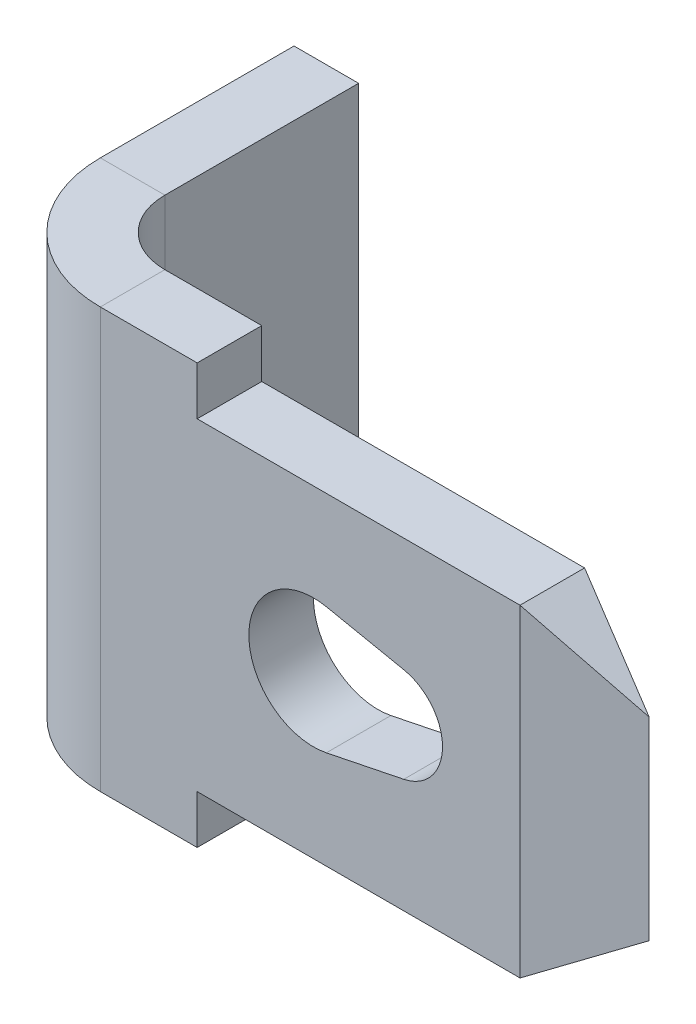
ISO-10303-21;
HEADER;
FILE_DESCRIPTION(('STEP AP214'),'2;1');
FILE_NAME('part.step','',(''),(''),'','','');
FILE_SCHEMA(('AUTOMOTIVE_DESIGN { 1 0 10303 214 1 1 1 1 }'));
ENDSEC;
DATA;
#1=APPLICATION_CONTEXT('core data for automotive mechanical design processes');
#2=APPLICATION_PROTOCOL_DEFINITION('international standard','automotive_design',2000,#1);
#3=PRODUCT_CONTEXT('',#1,'mechanical');
#4=PRODUCT('Part','Part','',(#3));
#5=PRODUCT_RELATED_PRODUCT_CATEGORY('part','',(#4));
#6=PRODUCT_DEFINITION_FORMATION('','',#4);
#7=PRODUCT_DEFINITION_CONTEXT('part definition',#1,'design');
#8=PRODUCT_DEFINITION('design','',#6,#7);
#9=PRODUCT_DEFINITION_SHAPE('','',#8);
#10=(LENGTH_UNIT() NAMED_UNIT(*) SI_UNIT(.MILLI.,.METRE.));
#11=(NAMED_UNIT(*) PLANE_ANGLE_UNIT() SI_UNIT($,.RADIAN.));
#12=(NAMED_UNIT(*) SI_UNIT($,.STERADIAN.) SOLID_ANGLE_UNIT());
#13=UNCERTAINTY_MEASURE_WITH_UNIT(LENGTH_MEASURE(1.E-05),#10,'distance_accuracy_value','');
#14=(GEOMETRIC_REPRESENTATION_CONTEXT(3) GLOBAL_UNCERTAINTY_ASSIGNED_CONTEXT((#13)) GLOBAL_UNIT_ASSIGNED_CONTEXT((#10,
#11,#12)) REPRESENTATION_CONTEXT('',''));
#15=CARTESIAN_POINT('',(0.,0.,0.));
#16=DIRECTION('',(0.,0.,1.));
#17=DIRECTION('',(1.,0.,0.));
#18=AXIS2_PLACEMENT_3D('',#15,#16,#17);
#19=CARTESIAN_POINT('',(7.55,0.,0.));
#20=DIRECTION('',(0.,0.,-1.));
#21=DIRECTION('',(-1.,0.,0.));
#22=AXIS2_PLACEMENT_3D('',#19,#20,#21);
#23=CYLINDRICAL_SURFACE('',#22,0.75);
#24=DIRECTION('',(0.,0.,-1.));
#25=VECTOR('',#24,1.);
#26=CARTESIAN_POINT('',(7.7,-0.734846922834954,0.));
#27=LINE('',#26,#25);
#28=CARTESIAN_POINT('',(7.7,-0.734846922834953,1.));
#29=VERTEX_POINT('',#28);
#30=CARTESIAN_POINT('',(7.7,-0.734846922834954,0.));
#31=VERTEX_POINT('',#30);
#32=EDGE_CURVE('E12',#29,#31,#27,.T.);
#33=ORIENTED_EDGE('',*,*,#32,.F.);
#34=CARTESIAN_POINT('',(7.55,0.,0.999999999999999));
#35=DIRECTION('',(0.,0.,-1.));
#36=DIRECTION('',(-1.,0.,0.));
#37=AXIS2_PLACEMENT_3D('',#34,#35,#36);
#38=CIRCLE('',#37,0.75);
#39=CARTESIAN_POINT('',(7.7,0.734846922834953,1.));
#40=VERTEX_POINT('',#39);
#41=EDGE_CURVE('E141',#29,#40,#38,.F.);
#42=ORIENTED_EDGE('',*,*,#41,.T.);
#43=DIRECTION('',(0.,0.,-1.));
#44=VECTOR('',#43,1.);
#45=CARTESIAN_POINT('',(7.7,0.734846922834953,0.));
#46=LINE('',#45,#44);
#47=CARTESIAN_POINT('',(7.7,0.734846922834953,0.));
#48=VERTEX_POINT('',#47);
#49=EDGE_CURVE('E62',#40,#48,#46,.T.);
#50=ORIENTED_EDGE('',*,*,#49,.T.);
#51=CARTESIAN_POINT('',(7.55,0.,0.));
#52=DIRECTION('',(0.,0.,-1.));
#53=DIRECTION('',(-1.,0.,0.));
#54=AXIS2_PLACEMENT_3D('',#51,#52,#53);
#55=CIRCLE('',#54,0.75);
#56=EDGE_CURVE('E196',#31,#48,#55,.F.);
#57=ORIENTED_EDGE('',*,*,#56,.F.);
#58=EDGE_LOOP('',(#33,#42,#50,#57));
#59=FACE_BOUND('',#58,.T.);
#60=ADVANCED_FACE('F52',(#59),#23,.F.);
#61=CARTESIAN_POINT('',(6.5,0.979795897113271,0.));
#62=DIRECTION('',(-0.2,-0.979795897113271,0.));
#63=DIRECTION('',(-0.979795897113271,0.2,0.));
#64=AXIS2_PLACEMENT_3D('',#61,#62,#63);
#65=PLANE('',#64);
#66=ORIENTED_EDGE('',*,*,#49,.F.);
#67=DIRECTION('',(-0.979795897113271,0.2,0.));
#68=VECTOR('',#67,1.);
#69=CARTESIAN_POINT('',(6.5,0.979795897113271,0.999999999999999));
#70=LINE('',#69,#68);
#71=CARTESIAN_POINT('',(6.5,0.97979589711327,1.));
#72=VERTEX_POINT('',#71);
#73=EDGE_CURVE('E154',#40,#72,#70,.T.);
#74=ORIENTED_EDGE('',*,*,#73,.T.);
#75=DIRECTION('',(0.,0.,-1.));
#76=VECTOR('',#75,1.);
#77=CARTESIAN_POINT('',(6.5,0.979795897113271,0.));
#78=LINE('',#77,#76);
#79=CARTESIAN_POINT('',(6.5,0.979795897113271,0.));
#80=VERTEX_POINT('',#79);
#81=EDGE_CURVE('E133',#72,#80,#78,.T.);
#82=ORIENTED_EDGE('',*,*,#81,.T.);
#83=DIRECTION('',(-0.979795897113271,0.2,0.));
#84=VECTOR('',#83,1.);
#85=CARTESIAN_POINT('',(6.5,0.979795897113271,0.));
#86=LINE('',#85,#84);
#87=EDGE_CURVE('E204',#48,#80,#86,.T.);
#88=ORIENTED_EDGE('',*,*,#87,.F.);
#89=EDGE_LOOP('',(#66,#74,#82,#88));
#90=FACE_BOUND('',#89,.T.);
#91=ADVANCED_FACE('F206',(#90),#65,.T.);
#92=CARTESIAN_POINT('',(6.3,0.,0.));
#93=DIRECTION('',(0.,0.,-1.));
#94=DIRECTION('',(-1.,0.,0.));
#95=AXIS2_PLACEMENT_3D('',#92,#93,#94);
#96=CYLINDRICAL_SURFACE('',#95,1.);
#97=ORIENTED_EDGE('',*,*,#81,.F.);
#98=CARTESIAN_POINT('',(6.3,0.,0.999999999999999));
#99=DIRECTION('',(0.,0.,-1.));
#100=DIRECTION('',(-1.,0.,0.));
#101=AXIS2_PLACEMENT_3D('',#98,#99,#100);
#102=CIRCLE('',#101,1.);
#103=CARTESIAN_POINT('',(6.5,-0.979795897113271,1.));
#104=VERTEX_POINT('',#103);
#105=EDGE_CURVE('E139',#72,#104,#102,.F.);
#106=ORIENTED_EDGE('',*,*,#105,.T.);
#107=DIRECTION('',(0.,0.,-1.));
#108=VECTOR('',#107,1.);
#109=CARTESIAN_POINT('',(6.5,-0.979795897113272,0.));
#110=LINE('',#109,#108);
#111=CARTESIAN_POINT('',(6.5,-0.979795897113272,0.));
#112=VERTEX_POINT('',#111);
#113=EDGE_CURVE('E56',#104,#112,#110,.T.);
#114=ORIENTED_EDGE('',*,*,#113,.T.);
#115=CARTESIAN_POINT('',(6.3,0.,0.));
#116=DIRECTION('',(0.,0.,-1.));
#117=DIRECTION('',(-1.,0.,0.));
#118=AXIS2_PLACEMENT_3D('',#115,#116,#117);
#119=CIRCLE('',#118,1.);
#120=EDGE_CURVE('E304',#80,#112,#119,.F.);
#121=ORIENTED_EDGE('',*,*,#120,.F.);
#122=EDGE_LOOP('',(#97,#106,#114,#121));
#123=FACE_BOUND('',#122,.T.);
#124=ADVANCED_FACE('F143',(#123),#96,.F.);
#125=CARTESIAN_POINT('',(2.,-3.25,-4.));
#126=DIRECTION('',(0.,-1.,0.));
#127=DIRECTION('',(0.,0.,1.));
#128=AXIS2_PLACEMENT_3D('',#125,#126,#127);
#129=PLANE('',#128);
#130=DIRECTION('',(1.,0.,0.));
#131=VECTOR('',#130,1.);
#132=CARTESIAN_POINT('',(2.,-3.25,-1.));
#133=LINE('',#132,#131);
#134=CARTESIAN_POINT('',(0.999999999999999,-3.25,-1.));
#135=VERTEX_POINT('',#134);
#136=CARTESIAN_POINT('',(2.,-3.25,-1.));
#137=VERTEX_POINT('',#136);
#138=EDGE_CURVE('E134',#135,#137,#133,.T.);
#139=ORIENTED_EDGE('',*,*,#138,.F.);
#140=DIRECTION('',(0.,0.,1.));
#141=VECTOR('',#140,1.);
#142=CARTESIAN_POINT('',(0.999999999999999,-3.25,-4.));
#143=LINE('',#142,#141);
#144=CARTESIAN_POINT('',(0.999999999999999,-3.25,-4.));
#145=VERTEX_POINT('',#144);
#146=EDGE_CURVE('E245',#145,#135,#143,.T.);
#147=ORIENTED_EDGE('',*,*,#146,.F.);
#148=DIRECTION('',(1.,0.,0.));
#149=VECTOR('',#148,1.);
#150=CARTESIAN_POINT('',(2.,-3.25,-4.));
#151=LINE('',#150,#149);
#152=CARTESIAN_POINT('',(2.,-3.25,-4.));
#153=VERTEX_POINT('',#152);
#154=EDGE_CURVE('E184',#145,#153,#151,.T.);
#155=ORIENTED_EDGE('',*,*,#154,.T.);
#156=DIRECTION('',(0.,0.,1.));
#157=VECTOR('',#156,1.);
#158=CARTESIAN_POINT('',(2.,-3.25,-4.));
#159=LINE('',#158,#157);
#160=EDGE_CURVE('E222',#153,#137,#159,.T.);
#161=ORIENTED_EDGE('',*,*,#160,.T.);
#162=EDGE_LOOP('',(#139,#147,#155,#161));
#163=FACE_BOUND('',#162,.T.);
#164=ADVANCED_FACE('F326',(#163),#129,.T.);
#165=CARTESIAN_POINT('',(2.,-3.25,-4.));
#166=DIRECTION('',(0.,0.,-1.));
#167=DIRECTION('',(0.,-1.,0.));
#168=AXIS2_PLACEMENT_3D('',#165,#166,#167);
#169=PLANE('',#168);
#170=ORIENTED_EDGE('',*,*,#154,.F.);
#171=DIRECTION('',(0.,1.,0.));
#172=VECTOR('',#171,1.);
#173=CARTESIAN_POINT('',(0.999999999999999,-3.25,-4.));
#174=LINE('',#173,#172);
#175=CARTESIAN_POINT('',(0.999999999999999,3.25,-4.));
#176=VERTEX_POINT('',#175);
#177=EDGE_CURVE('E248',#176,#145,#174,.F.);
#178=ORIENTED_EDGE('',*,*,#177,.F.);
#179=DIRECTION('',(1.,0.,0.));
#180=VECTOR('',#179,1.);
#181=CARTESIAN_POINT('',(2.,3.25,-4.));
#182=LINE('',#181,#180);
#183=CARTESIAN_POINT('',(2.,3.25,-4.));
#184=VERTEX_POINT('',#183);
#185=EDGE_CURVE('E181',#176,#184,#182,.T.);
#186=ORIENTED_EDGE('',*,*,#185,.T.);
#187=DIRECTION('',(0.,-1.,0.));
#188=VECTOR('',#187,1.);
#189=CARTESIAN_POINT('',(2.,-3.25,-4.));
#190=LINE('',#189,#188);
#191=EDGE_CURVE('E281',#184,#153,#190,.T.);
#192=ORIENTED_EDGE('',*,*,#191,.T.);
#193=EDGE_LOOP('',(#170,#178,#186,#192));
#194=FACE_BOUND('',#193,.T.);
#195=ADVANCED_FACE('F329',(#194),#169,.T.);
#196=CARTESIAN_POINT('',(2.,3.25,-4.));
#197=DIRECTION('',(0.,-1.,0.));
#198=DIRECTION('',(0.,0.,1.));
#199=AXIS2_PLACEMENT_3D('',#196,#197,#198);
#200=PLANE('',#199);
#201=ORIENTED_EDGE('',*,*,#185,.F.);
#202=DIRECTION('',(0.,0.,1.));
#203=VECTOR('',#202,1.);
#204=CARTESIAN_POINT('',(0.999999999999999,3.25,-4.));
#205=LINE('',#204,#203);
#206=CARTESIAN_POINT('',(0.999999999999999,3.25,-1.));
#207=VERTEX_POINT('',#206);
#208=EDGE_CURVE('E241',#176,#207,#205,.T.);
#209=ORIENTED_EDGE('',*,*,#208,.T.);
#210=DIRECTION('',(1.,0.,0.));
#211=VECTOR('',#210,1.);
#212=CARTESIAN_POINT('',(2.,3.25,-1.));
#213=LINE('',#212,#211);
#214=CARTESIAN_POINT('',(2.,3.25,-1.));
#215=VERTEX_POINT('',#214);
#216=EDGE_CURVE('E178',#207,#215,#213,.T.);
#217=ORIENTED_EDGE('',*,*,#216,.T.);
#218=DIRECTION('',(0.,0.,1.));
#219=VECTOR('',#218,1.);
#220=CARTESIAN_POINT('',(2.,3.25,-4.));
#221=LINE('',#220,#219);
#222=EDGE_CURVE('E284',#184,#215,#221,.T.);
#223=ORIENTED_EDGE('',*,*,#222,.F.);
#224=EDGE_LOOP('',(#201,#209,#217,#223));
#225=FACE_BOUND('',#224,.T.);
#226=ADVANCED_FACE('F312',(#225),#200,.F.);
#227=CARTESIAN_POINT('',(3.,3.25,-1.));
#228=DIRECTION('',(0.,-1.,0.));
#229=DIRECTION('',(0.,0.,-1.));
#230=AXIS2_PLACEMENT_3D('',#227,#228,#229);
#231=PLANE('',#230);
#232=ORIENTED_EDGE('',*,*,#216,.F.);
#233=CARTESIAN_POINT('',(3.,3.25,-1.));
#234=DIRECTION('',(0.,-1.,0.));
#235=DIRECTION('',(0.,0.,-1.));
#236=AXIS2_PLACEMENT_3D('',#233,#234,#235);
#237=CIRCLE('',#236,2.);
#238=CARTESIAN_POINT('',(3.,3.25,1.));
#239=VERTEX_POINT('',#238);
#240=EDGE_CURVE('E242',#207,#239,#237,.F.);
#241=ORIENTED_EDGE('',*,*,#240,.T.);
#242=DIRECTION('',(0.,0.,-1.));
#243=VECTOR('',#242,1.);
#244=CARTESIAN_POINT('',(3.,3.25,0.));
#245=LINE('',#244,#243);
#246=CARTESIAN_POINT('',(3.,3.25,0.));
#247=VERTEX_POINT('',#246);
#248=EDGE_CURVE('E176',#239,#247,#245,.T.);
#249=ORIENTED_EDGE('',*,*,#248,.T.);
#250=CARTESIAN_POINT('',(3.,3.25,-1.));
#251=DIRECTION('',(0.,1.,0.));
#252=DIRECTION('',(0.,0.,1.));
#253=AXIS2_PLACEMENT_3D('',#250,#251,#252);
#254=CIRCLE('',#253,1.);
#255=EDGE_CURVE('E218',#215,#247,#254,.T.);
#256=ORIENTED_EDGE('',*,*,#255,.F.);
#257=EDGE_LOOP('',(#232,#241,#249,#256));
#258=FACE_BOUND('',#257,.T.);
#259=ADVANCED_FACE('F321',(#258),#231,.F.);
#260=CARTESIAN_POINT('',(0.,3.25,0.));
#261=DIRECTION('',(0.,-1.,0.));
#262=DIRECTION('',(-1.,0.,0.));
#263=AXIS2_PLACEMENT_3D('',#260,#261,#262);
#264=PLANE('',#263);
#265=ORIENTED_EDGE('',*,*,#248,.F.);
#266=DIRECTION('',(-1.,0.,0.));
#267=VECTOR('',#266,1.);
#268=CARTESIAN_POINT('',(0.,3.25,1.));
#269=LINE('',#268,#267);
#270=CARTESIAN_POINT('',(4.5,3.25,1.));
#271=VERTEX_POINT('',#270);
#272=EDGE_CURVE('E238',#271,#239,#269,.T.);
#273=ORIENTED_EDGE('',*,*,#272,.F.);
#274=DIRECTION('',(0.,0.,-1.));
#275=VECTOR('',#274,1.);
#276=CARTESIAN_POINT('',(4.5,3.25,0.));
#277=LINE('',#276,#275);
#278=CARTESIAN_POINT('',(4.5,3.25,0.));
#279=VERTEX_POINT('',#278);
#280=EDGE_CURVE('E173',#271,#279,#277,.T.);
#281=ORIENTED_EDGE('',*,*,#280,.T.);
#282=DIRECTION('',(-1.,0.,0.));
#283=VECTOR('',#282,1.);
#284=CARTESIAN_POINT('',(0.,3.25,0.));
#285=LINE('',#284,#283);
#286=EDGE_CURVE('E287',#279,#247,#285,.T.);
#287=ORIENTED_EDGE('',*,*,#286,.T.);
#288=EDGE_LOOP('',(#265,#273,#281,#287));
#289=FACE_BOUND('',#288,.T.);
#290=ADVANCED_FACE('F375',(#289),#264,.F.);
#291=CARTESIAN_POINT('',(4.5,3.25,0.));
#292=DIRECTION('',(-1.,0.,0.));
#293=DIRECTION('',(0.,1.,0.));
#294=AXIS2_PLACEMENT_3D('',#291,#292,#293);
#295=PLANE('',#294);
#296=ORIENTED_EDGE('',*,*,#280,.F.);
#297=DIRECTION('',(0.,1.,0.));
#298=VECTOR('',#297,1.);
#299=CARTESIAN_POINT('',(4.5,0.,1.));
#300=LINE('',#299,#298);
#301=CARTESIAN_POINT('',(4.5,2.5,1.));
#302=VERTEX_POINT('',#301);
#303=EDGE_CURVE('E235',#302,#271,#300,.T.);
#304=ORIENTED_EDGE('',*,*,#303,.F.);
#305=DIRECTION('',(0.,0.,-1.));
#306=VECTOR('',#305,1.);
#307=CARTESIAN_POINT('',(4.5,2.5,0.));
#308=LINE('',#307,#306);
#309=CARTESIAN_POINT('',(4.5,2.5,0.));
#310=VERTEX_POINT('',#309);
#311=EDGE_CURVE('E170',#302,#310,#308,.T.);
#312=ORIENTED_EDGE('',*,*,#311,.T.);
#313=DIRECTION('',(0.,1.,0.));
#314=VECTOR('',#313,1.);
#315=CARTESIAN_POINT('',(4.5,3.25,0.));
#316=LINE('',#315,#314);
#317=EDGE_CURVE('E290',#310,#279,#316,.T.);
#318=ORIENTED_EDGE('',*,*,#317,.T.);
#319=EDGE_LOOP('',(#296,#304,#312,#318));
#320=FACE_BOUND('',#319,.T.);
#321=ADVANCED_FACE('F378',(#320),#295,.F.);
#322=CARTESIAN_POINT('',(4.5,2.5,0.));
#323=DIRECTION('',(0.,-1.,0.));
#324=DIRECTION('',(-1.,0.,0.));
#325=AXIS2_PLACEMENT_3D('',#322,#323,#324);
#326=PLANE('',#325);
#327=ORIENTED_EDGE('',*,*,#311,.F.);
#328=DIRECTION('',(-1.,0.,0.));
#329=VECTOR('',#328,1.);
#330=CARTESIAN_POINT('',(0.,2.5,1.));
#331=LINE('',#330,#329);
#332=CARTESIAN_POINT('',(9.5,2.5,1.));
#333=VERTEX_POINT('',#332);
#334=EDGE_CURVE('E232',#333,#302,#331,.T.);
#335=ORIENTED_EDGE('',*,*,#334,.F.);
#336=DIRECTION('',(0.,0.,-1.));
#337=VECTOR('',#336,1.);
#338=CARTESIAN_POINT('',(9.5,2.5,0.));
#339=LINE('',#338,#337);
#340=CARTESIAN_POINT('',(9.5,2.5,0.));
#341=VERTEX_POINT('',#340);
#342=EDGE_CURVE('E167',#333,#341,#339,.T.);
#343=ORIENTED_EDGE('',*,*,#342,.T.);
#344=DIRECTION('',(-1.,0.,0.));
#345=VECTOR('',#344,1.);
#346=CARTESIAN_POINT('',(4.5,2.5,0.));
#347=LINE('',#346,#345);
#348=EDGE_CURVE('E293',#341,#310,#347,.T.);
#349=ORIENTED_EDGE('',*,*,#348,.T.);
#350=EDGE_LOOP('',(#327,#335,#343,#349));
#351=FACE_BOUND('',#350,.T.);
#352=ADVANCED_FACE('F382',(#351),#326,.F.);
#353=CARTESIAN_POINT('',(9.5,2.5,0.));
#354=DIRECTION('',(-0.554700196225229,-0.832050294337844,0.));
#355=DIRECTION('',(-0.832050294337844,0.554700196225229,0.));
#356=AXIS2_PLACEMENT_3D('',#353,#354,#355);
#357=PLANE('',#356);
#358=DIRECTION('',(-0.801783725737273,0.534522483824849,0.267261241912424));
#359=VECTOR('',#358,1.);
#360=CARTESIAN_POINT('',(3.28528571428572,6.64314285714286,3.07157142857143));
#361=LINE('',#360,#359);
#362=CARTESIAN_POINT('',(11.,1.5,0.500000000000001));
#363=VERTEX_POINT('',#362);
#364=EDGE_CURVE('E441',#333,#363,#361,.F.);
#365=ORIENTED_EDGE('',*,*,#364,.T.);
#366=DIRECTION('',(0.801783725737273,-0.534522483824849,0.267261241912424));
#367=VECTOR('',#366,1.);
#368=CARTESIAN_POINT('',(3.071,6.786,-2.143));
#369=LINE('',#368,#367);
#370=EDGE_CURVE('E266',#363,#341,#369,.F.);
#371=ORIENTED_EDGE('',*,*,#370,.T.);
#372=ORIENTED_EDGE('',*,*,#342,.F.);
#373=EDGE_LOOP('',(#365,#371,#372));
#374=FACE_BOUND('',#373,.T.);
#375=ADVANCED_FACE('F386',(#374),#357,.F.);
#376=CARTESIAN_POINT('',(9.5,-2.5,0.));
#377=DIRECTION('',(-0.554700196225229,0.832050294337844,0.));
#378=DIRECTION('',(0.832050294337844,0.554700196225229,0.));
#379=AXIS2_PLACEMENT_3D('',#376,#377,#378);
#380=PLANE('',#379);
#381=DIRECTION('',(0.801783725737273,0.534522483824849,-0.267261241912424));
#382=VECTOR('',#381,1.);
#383=CARTESIAN_POINT('',(6.07185714285714,-4.78542857142857,2.14271428571429));
#384=LINE('',#383,#382);
#385=CARTESIAN_POINT('',(11.,-1.5,0.5));
#386=VERTEX_POINT('',#385);
#387=CARTESIAN_POINT('',(9.5,-2.5,1.));
#388=VERTEX_POINT('',#387);
#389=EDGE_CURVE('E439',#386,#388,#384,.F.);
#390=ORIENTED_EDGE('',*,*,#389,.T.);
#391=DIRECTION('',(0.,0.,-1.));
#392=VECTOR('',#391,1.);
#393=CARTESIAN_POINT('',(9.5,-2.5,0.));
#394=LINE('',#393,#392);
#395=CARTESIAN_POINT('',(9.5,-2.5,0.));
#396=VERTEX_POINT('',#395);
#397=EDGE_CURVE('E164',#388,#396,#394,.T.);
#398=ORIENTED_EDGE('',*,*,#397,.T.);
#399=DIRECTION('',(-0.801783725737273,-0.534522483824849,-0.267261241912424));
#400=VECTOR('',#399,1.);
#401=CARTESIAN_POINT('',(5.85757142857143,-4.92828571428571,-1.21414285714286));
#402=LINE('',#401,#400);
#403=EDGE_CURVE('E442',#396,#386,#402,.F.);
#404=ORIENTED_EDGE('',*,*,#403,.T.);
#405=EDGE_LOOP('',(#390,#398,#404));
#406=FACE_BOUND('',#405,.T.);
#407=ADVANCED_FACE('F390',(#406),#380,.F.);
#408=CARTESIAN_POINT('',(4.5,-2.5,0.));
#409=DIRECTION('',(0.,1.,0.));
#410=DIRECTION('',(1.,0.,0.));
#411=AXIS2_PLACEMENT_3D('',#408,#409,#410);
#412=PLANE('',#411);
#413=ORIENTED_EDGE('',*,*,#397,.F.);
#414=DIRECTION('',(-1.,0.,0.));
#415=VECTOR('',#414,1.);
#416=CARTESIAN_POINT('',(0.,-2.5,1.));
#417=LINE('',#416,#415);
#418=CARTESIAN_POINT('',(4.5,-2.5,1.));
#419=VERTEX_POINT('',#418);
#420=EDGE_CURVE('E229',#419,#388,#417,.F.);
#421=ORIENTED_EDGE('',*,*,#420,.F.);
#422=DIRECTION('',(0.,0.,-1.));
#423=VECTOR('',#422,1.);
#424=CARTESIAN_POINT('',(4.5,-2.5,0.));
#425=LINE('',#424,#423);
#426=CARTESIAN_POINT('',(4.5,-2.5,0.));
#427=VERTEX_POINT('',#426);
#428=EDGE_CURVE('E161',#419,#427,#425,.T.);
#429=ORIENTED_EDGE('',*,*,#428,.T.);
#430=DIRECTION('',(1.,0.,0.));
#431=VECTOR('',#430,1.);
#432=CARTESIAN_POINT('',(4.5,-2.5,0.));
#433=LINE('',#432,#431);
#434=EDGE_CURVE('E296',#427,#396,#433,.T.);
#435=ORIENTED_EDGE('',*,*,#434,.T.);
#436=EDGE_LOOP('',(#413,#421,#429,#435));
#437=FACE_BOUND('',#436,.T.);
#438=ADVANCED_FACE('F356',(#437),#412,.F.);
#439=CARTESIAN_POINT('',(4.5,-3.25,0.));
#440=DIRECTION('',(-1.,0.,0.));
#441=DIRECTION('',(0.,1.,0.));
#442=AXIS2_PLACEMENT_3D('',#439,#440,#441);
#443=PLANE('',#442);
#444=ORIENTED_EDGE('',*,*,#428,.F.);
#445=DIRECTION('',(0.,1.,0.));
#446=VECTOR('',#445,1.);
#447=CARTESIAN_POINT('',(4.5,0.,1.));
#448=LINE('',#447,#446);
#449=CARTESIAN_POINT('',(4.5,-3.25,1.));
#450=VERTEX_POINT('',#449);
#451=EDGE_CURVE('E148',#450,#419,#448,.T.);
#452=ORIENTED_EDGE('',*,*,#451,.F.);
#453=DIRECTION('',(0.,0.,-1.));
#454=VECTOR('',#453,1.);
#455=CARTESIAN_POINT('',(4.5,-3.25,0.));
#456=LINE('',#455,#454);
#457=CARTESIAN_POINT('',(4.5,-3.25,0.));
#458=VERTEX_POINT('',#457);
#459=EDGE_CURVE('E158',#450,#458,#456,.T.);
#460=ORIENTED_EDGE('',*,*,#459,.T.);
#461=DIRECTION('',(0.,1.,0.));
#462=VECTOR('',#461,1.);
#463=CARTESIAN_POINT('',(4.5,-3.25,0.));
#464=LINE('',#463,#462);
#465=EDGE_CURVE('E299',#458,#427,#464,.T.);
#466=ORIENTED_EDGE('',*,*,#465,.T.);
#467=EDGE_LOOP('',(#444,#452,#460,#466));
#468=FACE_BOUND('',#467,.T.);
#469=ADVANCED_FACE('F345',(#468),#443,.F.);
#470=CARTESIAN_POINT('',(0.,-3.25,0.));
#471=DIRECTION('',(0.,1.,0.));
#472=DIRECTION('',(1.,0.,0.));
#473=AXIS2_PLACEMENT_3D('',#470,#471,#472);
#474=PLANE('',#473);
#475=ORIENTED_EDGE('',*,*,#459,.F.);
#476=DIRECTION('',(-1.,0.,0.));
#477=VECTOR('',#476,1.);
#478=CARTESIAN_POINT('',(0.,-3.25,1.));
#479=LINE('',#478,#477);
#480=CARTESIAN_POINT('',(3.,-3.25,1.));
#481=VERTEX_POINT('',#480);
#482=EDGE_CURVE('E145',#481,#450,#479,.F.);
#483=ORIENTED_EDGE('',*,*,#482,.F.);
#484=DIRECTION('',(0.,0.,-1.));
#485=VECTOR('',#484,1.);
#486=CARTESIAN_POINT('',(3.,-3.25,0.));
#487=LINE('',#486,#485);
#488=CARTESIAN_POINT('',(3.,-3.25,0.));
#489=VERTEX_POINT('',#488);
#490=EDGE_CURVE('E70',#481,#489,#487,.T.);
#491=ORIENTED_EDGE('',*,*,#490,.T.);
#492=DIRECTION('',(1.,0.,0.));
#493=VECTOR('',#492,1.);
#494=CARTESIAN_POINT('',(0.,-3.25,0.));
#495=LINE('',#494,#493);
#496=EDGE_CURVE('E302',#489,#458,#495,.T.);
#497=ORIENTED_EDGE('',*,*,#496,.T.);
#498=EDGE_LOOP('',(#475,#483,#491,#497));
#499=FACE_BOUND('',#498,.T.);
#500=ADVANCED_FACE('F348',(#499),#474,.F.);
#501=CARTESIAN_POINT('',(3.,-3.25,-1.));
#502=DIRECTION('',(0.,-1.,0.));
#503=DIRECTION('',(0.,0.,-1.));
#504=AXIS2_PLACEMENT_3D('',#501,#502,#503);
#505=PLANE('',#504);
#506=CARTESIAN_POINT('',(3.,-3.25,-1.));
#507=DIRECTION('',(0.,-1.,0.));
#508=DIRECTION('',(0.,0.,-1.));
#509=AXIS2_PLACEMENT_3D('',#506,#507,#508);
#510=CIRCLE('',#509,2.);
#511=EDGE_CURVE('E152',#481,#135,#510,.T.);
#512=ORIENTED_EDGE('',*,*,#511,.T.);
#513=ORIENTED_EDGE('',*,*,#138,.T.);
#514=CARTESIAN_POINT('',(3.,-3.25,-1.));
#515=DIRECTION('',(0.,1.,0.));
#516=DIRECTION('',(0.,0.,1.));
#517=AXIS2_PLACEMENT_3D('',#514,#515,#516);
#518=CIRCLE('',#517,1.);
#519=EDGE_CURVE('E215',#489,#137,#518,.F.);
#520=ORIENTED_EDGE('',*,*,#519,.F.);
#521=ORIENTED_EDGE('',*,*,#490,.F.);
#522=EDGE_LOOP('',(#512,#513,#520,#521));
#523=FACE_BOUND('',#522,.T.);
#524=ADVANCED_FACE('F262',(#523),#505,.T.);
#525=CARTESIAN_POINT('',(6.5,-0.979795897113272,0.));
#526=DIRECTION('',(-0.2,0.979795897113271,0.));
#527=DIRECTION('',(0.979795897113271,0.2,0.));
#528=AXIS2_PLACEMENT_3D('',#525,#526,#527);
#529=PLANE('',#528);
#530=DIRECTION('',(0.979795897113271,0.2,0.));
#531=VECTOR('',#530,1.);
#532=CARTESIAN_POINT('',(6.5,-0.979795897113272,0.999999999999999));
#533=LINE('',#532,#531);
#534=EDGE_CURVE('E125',#104,#29,#533,.T.);
#535=ORIENTED_EDGE('',*,*,#534,.T.);
#536=ORIENTED_EDGE('',*,*,#32,.T.);
#537=DIRECTION('',(0.979795897113271,0.2,0.));
#538=VECTOR('',#537,1.);
#539=CARTESIAN_POINT('',(6.5,-0.979795897113272,0.));
#540=LINE('',#539,#538);
#541=EDGE_CURVE('E128',#112,#31,#540,.T.);
#542=ORIENTED_EDGE('',*,*,#541,.F.);
#543=ORIENTED_EDGE('',*,*,#113,.F.);
#544=EDGE_LOOP('',(#535,#536,#542,#543));
#545=FACE_BOUND('',#544,.T.);
#546=ADVANCED_FACE('F54',(#545),#529,.T.);
#547=CARTESIAN_POINT('',(0.,0.,0.));
#548=DIRECTION('',(0.,0.,-1.));
#549=DIRECTION('',(-1.,0.,0.));
#550=AXIS2_PLACEMENT_3D('',#547,#548,#549);
#551=PLANE('',#550);
#552=DIRECTION('',(0.,-1.,0.));
#553=VECTOR('',#552,1.);
#554=CARTESIAN_POINT('',(9.5,3.251,0.));
#555=LINE('',#554,#553);
#556=EDGE_CURVE('E268',#341,#396,#555,.T.);
#557=ORIENTED_EDGE('',*,*,#556,.T.);
#558=ORIENTED_EDGE('',*,*,#434,.F.);
#559=ORIENTED_EDGE('',*,*,#465,.F.);
#560=ORIENTED_EDGE('',*,*,#496,.F.);
#561=DIRECTION('',(0.,-1.,0.));
#562=VECTOR('',#561,1.);
#563=CARTESIAN_POINT('',(3.,0.,0.));
#564=LINE('',#563,#562);
#565=EDGE_CURVE('E190',#489,#247,#564,.F.);
#566=ORIENTED_EDGE('',*,*,#565,.T.);
#567=ORIENTED_EDGE('',*,*,#286,.F.);
#568=ORIENTED_EDGE('',*,*,#317,.F.);
#569=ORIENTED_EDGE('',*,*,#348,.F.);
#570=EDGE_LOOP('',(#557,#558,#559,#560,#566,#567,#568,#569));
#571=FACE_BOUND('',#570,.T.);
#572=ORIENTED_EDGE('',*,*,#120,.T.);
#573=ORIENTED_EDGE('',*,*,#541,.T.);
#574=ORIENTED_EDGE('',*,*,#56,.T.);
#575=ORIENTED_EDGE('',*,*,#87,.T.);
#576=EDGE_LOOP('',(#572,#573,#574,#575));
#577=FACE_BOUND('',#576,.T.);
#578=ADVANCED_FACE('F203',(#571,#577),#551,.T.);
#579=CARTESIAN_POINT('',(2.,-3.25,-4.));
#580=DIRECTION('',(-1.,0.,0.));
#581=DIRECTION('',(0.,0.,1.));
#582=AXIS2_PLACEMENT_3D('',#579,#580,#581);
#583=PLANE('',#582);
#584=ORIENTED_EDGE('',*,*,#222,.T.);
#585=DIRECTION('',(0.,-1.,0.));
#586=VECTOR('',#585,1.);
#587=CARTESIAN_POINT('',(2.,-3.25,-1.));
#588=LINE('',#587,#586);
#589=EDGE_CURVE('E207',#215,#137,#588,.T.);
#590=ORIENTED_EDGE('',*,*,#589,.T.);
#591=ORIENTED_EDGE('',*,*,#160,.F.);
#592=ORIENTED_EDGE('',*,*,#191,.F.);
#593=EDGE_LOOP('',(#584,#590,#591,#592));
#594=FACE_BOUND('',#593,.T.);
#595=ADVANCED_FACE('F318',(#594),#583,.F.);
#596=CARTESIAN_POINT('',(3.,-3.25,-1.));
#597=DIRECTION('',(0.,-1.,0.));
#598=DIRECTION('',(0.,0.,-1.));
#599=AXIS2_PLACEMENT_3D('',#596,#597,#598);
#600=CYLINDRICAL_SURFACE('',#599,1.);
#601=ORIENTED_EDGE('',*,*,#255,.T.);
#602=ORIENTED_EDGE('',*,*,#565,.F.);
#603=ORIENTED_EDGE('',*,*,#519,.T.);
#604=ORIENTED_EDGE('',*,*,#589,.F.);
#605=EDGE_LOOP('',(#601,#602,#603,#604));
#606=FACE_BOUND('',#605,.T.);
#607=ADVANCED_FACE('F324',(#606),#600,.F.);
#608=CARTESIAN_POINT('',(0.,0.,1.));
#609=DIRECTION('',(0.,0.,-1.));
#610=DIRECTION('',(-1.,0.,0.));
#611=AXIS2_PLACEMENT_3D('',#608,#609,#610);
#612=PLANE('',#611);
#613=ORIENTED_EDGE('',*,*,#420,.T.);
#614=DIRECTION('',(0.,-1.,0.));
#615=VECTOR('',#614,1.);
#616=CARTESIAN_POINT('',(9.5,3.251,1.));
#617=LINE('',#616,#615);
#618=EDGE_CURVE('E409',#333,#388,#617,.T.);
#619=ORIENTED_EDGE('',*,*,#618,.F.);
#620=ORIENTED_EDGE('',*,*,#334,.T.);
#621=ORIENTED_EDGE('',*,*,#303,.T.);
#622=ORIENTED_EDGE('',*,*,#272,.T.);
#623=DIRECTION('',(0.,1.,0.));
#624=VECTOR('',#623,1.);
#625=CARTESIAN_POINT('',(3.,0.,1.));
#626=LINE('',#625,#624);
#627=EDGE_CURVE('E219',#481,#239,#626,.T.);
#628=ORIENTED_EDGE('',*,*,#627,.F.);
#629=ORIENTED_EDGE('',*,*,#482,.T.);
#630=ORIENTED_EDGE('',*,*,#451,.T.);
#631=EDGE_LOOP('',(#613,#619,#620,#621,#622,#628,#629,#630));
#632=FACE_BOUND('',#631,.T.);
#633=ORIENTED_EDGE('',*,*,#105,.F.);
#634=ORIENTED_EDGE('',*,*,#73,.F.);
#635=ORIENTED_EDGE('',*,*,#41,.F.);
#636=ORIENTED_EDGE('',*,*,#534,.F.);
#637=EDGE_LOOP('',(#633,#634,#635,#636));
#638=FACE_BOUND('',#637,.T.);
#639=ADVANCED_FACE('F137',(#632,#638),#612,.F.);
#640=CARTESIAN_POINT('',(0.999999999999999,-3.25,-4.));
#641=DIRECTION('',(-1.,0.,0.));
#642=DIRECTION('',(0.,0.,1.));
#643=AXIS2_PLACEMENT_3D('',#640,#641,#642);
#644=PLANE('',#643);
#645=ORIENTED_EDGE('',*,*,#208,.F.);
#646=ORIENTED_EDGE('',*,*,#177,.T.);
#647=ORIENTED_EDGE('',*,*,#146,.T.);
#648=DIRECTION('',(0.,1.,0.));
#649=VECTOR('',#648,1.);
#650=CARTESIAN_POINT('',(0.999999999999999,-3.25,-1.));
#651=LINE('',#650,#649);
#652=EDGE_CURVE('E156',#207,#135,#651,.F.);
#653=ORIENTED_EDGE('',*,*,#652,.F.);
#654=EDGE_LOOP('',(#645,#646,#647,#653));
#655=FACE_BOUND('',#654,.T.);
#656=ADVANCED_FACE('F256',(#655),#644,.T.);
#657=CARTESIAN_POINT('',(3.,-3.25,-1.));
#658=DIRECTION('',(0.,-1.,0.));
#659=DIRECTION('',(0.,0.,-1.));
#660=AXIS2_PLACEMENT_3D('',#657,#658,#659);
#661=CYLINDRICAL_SURFACE('',#660,2.);
#662=ORIENTED_EDGE('',*,*,#240,.F.);
#663=ORIENTED_EDGE('',*,*,#652,.T.);
#664=ORIENTED_EDGE('',*,*,#511,.F.);
#665=ORIENTED_EDGE('',*,*,#627,.T.);
#666=EDGE_LOOP('',(#662,#663,#664,#665));
#667=FACE_BOUND('',#666,.T.);
#668=ADVANCED_FACE('F411',(#667),#661,.T.);
#669=CARTESIAN_POINT('',(0.95,3.251,-2.85));
#670=DIRECTION('',(-0.316227766016838,0.,0.948683298050514));
#671=DIRECTION('',(0.948683298050514,0.,0.316227766016838));
#672=AXIS2_PLACEMENT_3D('',#669,#670,#671);
#673=PLANE('',#672);
#674=DIRECTION('',(0.,-1.,0.));
#675=VECTOR('',#674,1.);
#676=CARTESIAN_POINT('',(11.,3.251,0.5));
#677=LINE('',#676,#675);
#678=EDGE_CURVE('E275',#363,#386,#677,.T.);
#679=ORIENTED_EDGE('',*,*,#678,.T.);
#680=ORIENTED_EDGE('',*,*,#403,.F.);
#681=ORIENTED_EDGE('',*,*,#556,.F.);
#682=ORIENTED_EDGE('',*,*,#370,.F.);
#683=EDGE_LOOP('',(#679,#680,#681,#682));
#684=FACE_BOUND('',#683,.T.);
#685=ADVANCED_FACE('F413',(#684),#673,.F.);
#686=CARTESIAN_POINT('',(1.25,3.251,3.75));
#687=DIRECTION('',(-0.316227766016838,0.,-0.948683298050514));
#688=DIRECTION('',(-0.948683298050514,0.,0.316227766016838));
#689=AXIS2_PLACEMENT_3D('',#686,#687,#688);
#690=PLANE('',#689);
#691=ORIENTED_EDGE('',*,*,#618,.T.);
#692=ORIENTED_EDGE('',*,*,#389,.F.);
#693=ORIENTED_EDGE('',*,*,#678,.F.);
#694=ORIENTED_EDGE('',*,*,#364,.F.);
#695=EDGE_LOOP('',(#691,#692,#693,#694));
#696=FACE_BOUND('',#695,.T.);
#697=ADVANCED_FACE('F418',(#696),#690,.F.);
#698=CLOSED_SHELL('',(#60,#91,#124,#164,#195,#226,#259,#290,#321,#352,#375,#407,#438,#469,#500,
#524,#546,#578,#595,#607,#639,#656,#668,#685,#697));
#699=MANIFOLD_SOLID_BREP('B2',#698);
#700=ADVANCED_BREP_SHAPE_REPRESENTATION('',(#18,#699),#14);
#701=SHAPE_DEFINITION_REPRESENTATION(#9,#700);
ENDSEC;
END-ISO-10303-21;
